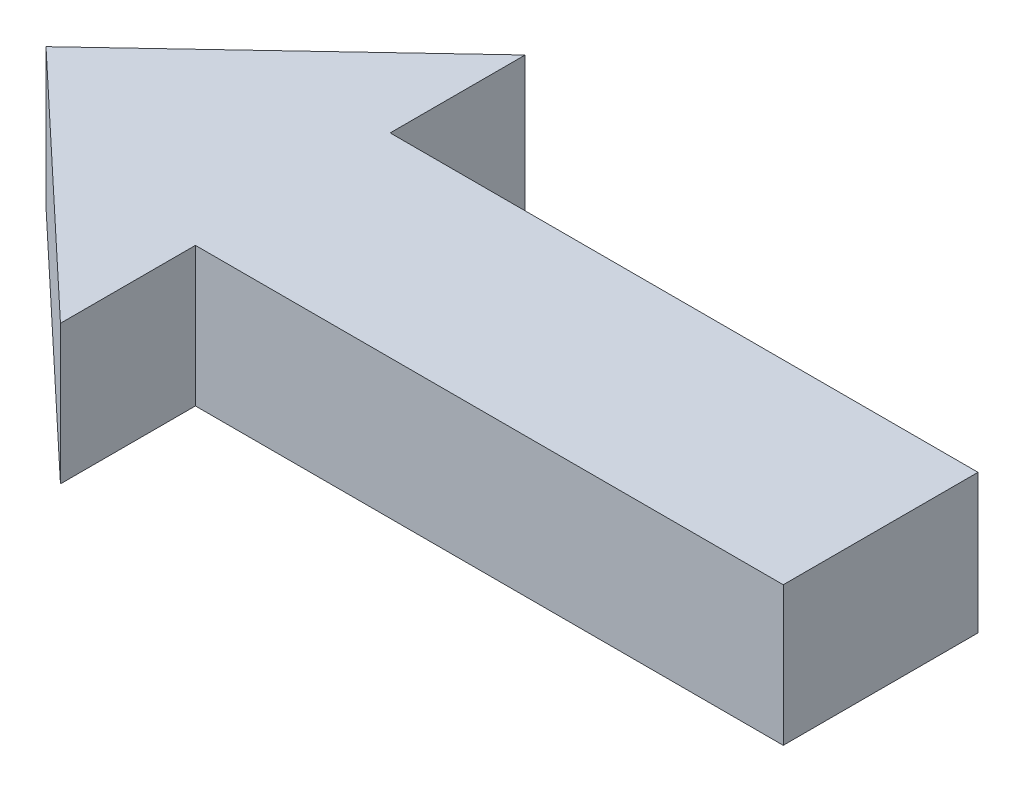
ISO-10303-21;
HEADER;
FILE_DESCRIPTION(('STEP AP214'),'2;1');
FILE_NAME('part.step','',(''),(''),'','','');
FILE_SCHEMA(('AUTOMOTIVE_DESIGN { 1 0 10303 214 1 1 1 1 }'));
ENDSEC;
DATA;
#1=APPLICATION_CONTEXT('core data for automotive mechanical design processes');
#2=APPLICATION_PROTOCOL_DEFINITION('international standard','automotive_design',2000,#1);
#3=PRODUCT_CONTEXT('',#1,'mechanical');
#4=PRODUCT('Part','Part','',(#3));
#5=PRODUCT_RELATED_PRODUCT_CATEGORY('part','',(#4));
#6=PRODUCT_DEFINITION_FORMATION('','',#4);
#7=PRODUCT_DEFINITION_CONTEXT('part definition',#1,'design');
#8=PRODUCT_DEFINITION('design','',#6,#7);
#9=PRODUCT_DEFINITION_SHAPE('','',#8);
#10=(LENGTH_UNIT() NAMED_UNIT(*) SI_UNIT(.MILLI.,.METRE.));
#11=(NAMED_UNIT(*) PLANE_ANGLE_UNIT() SI_UNIT($,.RADIAN.));
#12=(NAMED_UNIT(*) SI_UNIT($,.STERADIAN.) SOLID_ANGLE_UNIT());
#13=UNCERTAINTY_MEASURE_WITH_UNIT(LENGTH_MEASURE(1.E-05),#10,'distance_accuracy_value','');
#14=(GEOMETRIC_REPRESENTATION_CONTEXT(3) GLOBAL_UNCERTAINTY_ASSIGNED_CONTEXT((#13)) GLOBAL_UNIT_ASSIGNED_CONTEXT((#10,
#11,#12)) REPRESENTATION_CONTEXT('',''));
#15=CARTESIAN_POINT('',(0.,0.,0.));
#16=DIRECTION('',(0.,0.,1.));
#17=DIRECTION('',(1.,0.,0.));
#18=AXIS2_PLACEMENT_3D('',#15,#16,#17);
#19=CARTESIAN_POINT('',(0.,50.,0.));
#20=DIRECTION('',(-1.,0.,0.));
#21=DIRECTION('',(0.,0.,1.));
#22=AXIS2_PLACEMENT_3D('',#19,#20,#21);
#23=PLANE('',#22);
#24=DIRECTION('',(0.,0.,-1.));
#25=VECTOR('',#24,1.);
#26=CARTESIAN_POINT('',(0.,0.,0.));
#27=LINE('',#26,#25);
#28=CARTESIAN_POINT('',(0.,0.,70.));
#29=VERTEX_POINT('',#28);
#30=CARTESIAN_POINT('',(0.,0.,0.));
#31=VERTEX_POINT('',#30);
#32=EDGE_CURVE('E123',#29,#31,#27,.T.);
#33=ORIENTED_EDGE('',*,*,#32,.T.);
#34=DIRECTION('',(0.,-1.,0.));
#35=VECTOR('',#34,1.);
#36=CARTESIAN_POINT('',(0.,50.,0.));
#37=LINE('',#36,#35);
#38=CARTESIAN_POINT('',(0.,50.,0.));
#39=VERTEX_POINT('',#38);
#40=EDGE_CURVE('E11',#39,#31,#37,.T.);
#41=ORIENTED_EDGE('',*,*,#40,.F.);
#42=DIRECTION('',(0.,0.,-1.));
#43=VECTOR('',#42,1.);
#44=CARTESIAN_POINT('',(0.,50.,0.));
#45=LINE('',#44,#43);
#46=CARTESIAN_POINT('',(0.,50.,70.));
#47=VERTEX_POINT('',#46);
#48=EDGE_CURVE('E135',#47,#39,#45,.T.);
#49=ORIENTED_EDGE('',*,*,#48,.F.);
#50=DIRECTION('',(0.,-1.,0.));
#51=VECTOR('',#50,1.);
#52=CARTESIAN_POINT('',(0.,50.,70.));
#53=LINE('',#52,#51);
#54=EDGE_CURVE('E119',#47,#29,#53,.T.);
#55=ORIENTED_EDGE('',*,*,#54,.T.);
#56=EDGE_LOOP('',(#33,#41,#49,#55));
#57=FACE_BOUND('',#56,.T.);
#58=ADVANCED_FACE('F33',(#57),#23,.F.);
#59=CARTESIAN_POINT('',(0.,50.,0.));
#60=DIRECTION('',(0.,0.,1.));
#61=DIRECTION('',(1.,0.,0.));
#62=AXIS2_PLACEMENT_3D('',#59,#60,#61);
#63=PLANE('',#62);
#64=DIRECTION('',(-1.,0.,0.));
#65=VECTOR('',#64,1.);
#66=CARTESIAN_POINT('',(0.,0.,0.));
#67=LINE('',#66,#65);
#68=CARTESIAN_POINT('',(-211.29363449692,0.,0.));
#69=VERTEX_POINT('',#68);
#70=EDGE_CURVE('E126',#31,#69,#67,.T.);
#71=ORIENTED_EDGE('',*,*,#70,.T.);
#72=DIRECTION('',(0.,-1.,0.));
#73=VECTOR('',#72,1.);
#74=CARTESIAN_POINT('',(-211.29363449692,50.,0.));
#75=LINE('',#74,#73);
#76=CARTESIAN_POINT('',(-211.29363449692,50.,0.));
#77=VERTEX_POINT('',#76);
#78=EDGE_CURVE('E41',#77,#69,#75,.T.);
#79=ORIENTED_EDGE('',*,*,#78,.F.);
#80=DIRECTION('',(-1.,0.,0.));
#81=VECTOR('',#80,1.);
#82=CARTESIAN_POINT('',(0.,50.,0.));
#83=LINE('',#82,#81);
#84=EDGE_CURVE('E89',#39,#77,#83,.T.);
#85=ORIENTED_EDGE('',*,*,#84,.F.);
#86=ORIENTED_EDGE('',*,*,#40,.T.);
#87=EDGE_LOOP('',(#71,#79,#85,#86));
#88=FACE_BOUND('',#87,.T.);
#89=ADVANCED_FACE('F160',(#88),#63,.F.);
#90=CARTESIAN_POINT('',(-211.29363449692,50.,0.));
#91=DIRECTION('',(-1.,0.,0.));
#92=DIRECTION('',(0.,0.,1.));
#93=AXIS2_PLACEMENT_3D('',#90,#91,#92);
#94=PLANE('',#93);
#95=DIRECTION('',(0.,0.,-1.));
#96=VECTOR('',#95,1.);
#97=CARTESIAN_POINT('',(-211.29363449692,0.,0.));
#98=LINE('',#97,#96);
#99=CARTESIAN_POINT('',(-211.29363449692,0.,-48.5112936344969));
#100=VERTEX_POINT('',#99);
#101=EDGE_CURVE('E128',#69,#100,#98,.T.);
#102=ORIENTED_EDGE('',*,*,#101,.T.);
#103=DIRECTION('',(0.,-1.,0.));
#104=VECTOR('',#103,1.);
#105=CARTESIAN_POINT('',(-211.29363449692,50.,-48.5112936344969));
#106=LINE('',#105,#104);
#107=CARTESIAN_POINT('',(-211.29363449692,50.,-48.5112936344969));
#108=VERTEX_POINT('',#107);
#109=EDGE_CURVE('E139',#108,#100,#106,.T.);
#110=ORIENTED_EDGE('',*,*,#109,.F.);
#111=DIRECTION('',(0.,0.,-1.));
#112=VECTOR('',#111,1.);
#113=CARTESIAN_POINT('',(-211.29363449692,50.,0.));
#114=LINE('',#113,#112);
#115=EDGE_CURVE('E147',#77,#108,#114,.T.);
#116=ORIENTED_EDGE('',*,*,#115,.F.);
#117=ORIENTED_EDGE('',*,*,#78,.T.);
#118=EDGE_LOOP('',(#102,#110,#116,#117));
#119=FACE_BOUND('',#118,.T.);
#120=ADVANCED_FACE('F145',(#119),#94,.F.);
#121=CARTESIAN_POINT('',(-211.29363449692,50.,-48.5112936344969));
#122=DIRECTION('',(0.68546458137336,0.,0.728105972838188));
#123=DIRECTION('',(0.728105972838188,0.,-0.68546458137336));
#124=AXIS2_PLACEMENT_3D('',#121,#122,#123);
#125=PLANE('',#124);
#126=DIRECTION('',(-0.728105972838188,0.,0.68546458137336));
#127=VECTOR('',#126,1.);
#128=CARTESIAN_POINT('',(-211.29363449692,0.,-48.5112936344969));
#129=LINE('',#128,#127);
#130=CARTESIAN_POINT('',(-300.,0.,35.));
#131=VERTEX_POINT('',#130);
#132=EDGE_CURVE('E130',#100,#131,#129,.T.);
#133=ORIENTED_EDGE('',*,*,#132,.T.);
#134=DIRECTION('',(0.,-1.,0.));
#135=VECTOR('',#134,1.);
#136=CARTESIAN_POINT('',(-300.,50.,35.));
#137=LINE('',#136,#135);
#138=CARTESIAN_POINT('',(-300.,50.,35.));
#139=VERTEX_POINT('',#138);
#140=EDGE_CURVE('E114',#139,#131,#137,.T.);
#141=ORIENTED_EDGE('',*,*,#140,.F.);
#142=DIRECTION('',(-0.728105972838188,0.,0.68546458137336));
#143=VECTOR('',#142,1.);
#144=CARTESIAN_POINT('',(-211.29363449692,50.,-48.5112936344969));
#145=LINE('',#144,#143);
#146=EDGE_CURVE('E105',#108,#139,#145,.T.);
#147=ORIENTED_EDGE('',*,*,#146,.F.);
#148=ORIENTED_EDGE('',*,*,#109,.T.);
#149=EDGE_LOOP('',(#133,#141,#147,#148));
#150=FACE_BOUND('',#149,.T.);
#151=ADVANCED_FACE('F153',(#150),#125,.F.);
#152=CARTESIAN_POINT('',(-300.,50.,35.));
#153=DIRECTION('',(0.68546458137336,0.,-0.728105972838188));
#154=DIRECTION('',(-0.728105972838188,0.,-0.68546458137336));
#155=AXIS2_PLACEMENT_3D('',#152,#153,#154);
#156=PLANE('',#155);
#157=DIRECTION('',(0.728105972838188,0.,0.68546458137336));
#158=VECTOR('',#157,1.);
#159=CARTESIAN_POINT('',(-300.,0.,35.));
#160=LINE('',#159,#158);
#161=CARTESIAN_POINT('',(-211.29363449692,0.,118.511293634497));
#162=VERTEX_POINT('',#161);
#163=EDGE_CURVE('E113',#131,#162,#160,.T.);
#164=ORIENTED_EDGE('',*,*,#163,.T.);
#165=DIRECTION('',(0.,-1.,0.));
#166=VECTOR('',#165,1.);
#167=CARTESIAN_POINT('',(-211.29363449692,50.,118.511293634497));
#168=LINE('',#167,#166);
#169=CARTESIAN_POINT('',(-211.29363449692,50.,118.511293634497));
#170=VERTEX_POINT('',#169);
#171=EDGE_CURVE('E110',#170,#162,#168,.T.);
#172=ORIENTED_EDGE('',*,*,#171,.F.);
#173=DIRECTION('',(0.728105972838188,0.,0.68546458137336));
#174=VECTOR('',#173,1.);
#175=CARTESIAN_POINT('',(-300.,50.,35.));
#176=LINE('',#175,#174);
#177=EDGE_CURVE('E99',#139,#170,#176,.T.);
#178=ORIENTED_EDGE('',*,*,#177,.F.);
#179=ORIENTED_EDGE('',*,*,#140,.T.);
#180=EDGE_LOOP('',(#164,#172,#178,#179));
#181=FACE_BOUND('',#180,.T.);
#182=ADVANCED_FACE('F111',(#181),#156,.F.);
#183=CARTESIAN_POINT('',(-211.29363449692,50.,118.511293634497));
#184=DIRECTION('',(-1.,0.,0.));
#185=DIRECTION('',(0.,0.,1.));
#186=AXIS2_PLACEMENT_3D('',#183,#184,#185);
#187=PLANE('',#186);
#188=DIRECTION('',(0.,0.,-1.));
#189=VECTOR('',#188,1.);
#190=CARTESIAN_POINT('',(-211.29363449692,0.,118.511293634497));
#191=LINE('',#190,#189);
#192=CARTESIAN_POINT('',(-211.29363449692,0.,70.));
#193=VERTEX_POINT('',#192);
#194=EDGE_CURVE('E75',#162,#193,#191,.T.);
#195=ORIENTED_EDGE('',*,*,#194,.T.);
#196=DIRECTION('',(0.,-1.,0.));
#197=VECTOR('',#196,1.);
#198=CARTESIAN_POINT('',(-211.29363449692,50.,70.));
#199=LINE('',#198,#197);
#200=CARTESIAN_POINT('',(-211.29363449692,50.,70.));
#201=VERTEX_POINT('',#200);
#202=EDGE_CURVE('E115',#201,#193,#199,.T.);
#203=ORIENTED_EDGE('',*,*,#202,.F.);
#204=DIRECTION('',(0.,0.,-1.));
#205=VECTOR('',#204,1.);
#206=CARTESIAN_POINT('',(-211.29363449692,50.,118.511293634497));
#207=LINE('',#206,#205);
#208=EDGE_CURVE('E103',#170,#201,#207,.T.);
#209=ORIENTED_EDGE('',*,*,#208,.F.);
#210=ORIENTED_EDGE('',*,*,#171,.T.);
#211=EDGE_LOOP('',(#195,#203,#209,#210));
#212=FACE_BOUND('',#211,.T.);
#213=ADVANCED_FACE('F117',(#212),#187,.F.);
#214=CARTESIAN_POINT('',(0.,50.,70.));
#215=DIRECTION('',(0.,0.,-1.));
#216=DIRECTION('',(-1.,0.,0.));
#217=AXIS2_PLACEMENT_3D('',#214,#215,#216);
#218=PLANE('',#217);
#219=DIRECTION('',(1.,0.,0.));
#220=VECTOR('',#219,1.);
#221=CARTESIAN_POINT('',(0.,0.,70.));
#222=LINE('',#221,#220);
#223=EDGE_CURVE('E81',#193,#29,#222,.T.);
#224=ORIENTED_EDGE('',*,*,#223,.T.);
#225=ORIENTED_EDGE('',*,*,#54,.F.);
#226=DIRECTION('',(1.,0.,0.));
#227=VECTOR('',#226,1.);
#228=CARTESIAN_POINT('',(0.,50.,70.));
#229=LINE('',#228,#227);
#230=EDGE_CURVE('E49',#201,#47,#229,.T.);
#231=ORIENTED_EDGE('',*,*,#230,.F.);
#232=ORIENTED_EDGE('',*,*,#202,.T.);
#233=EDGE_LOOP('',(#224,#225,#231,#232));
#234=FACE_BOUND('',#233,.T.);
#235=ADVANCED_FACE('F174',(#234),#218,.F.);
#236=CARTESIAN_POINT('',(0.,50.,0.));
#237=DIRECTION('',(0.,-1.,0.));
#238=DIRECTION('',(0.,0.,-1.));
#239=AXIS2_PLACEMENT_3D('',#236,#237,#238);
#240=PLANE('',#239);
#241=ORIENTED_EDGE('',*,*,#48,.T.);
#242=ORIENTED_EDGE('',*,*,#84,.T.);
#243=ORIENTED_EDGE('',*,*,#115,.T.);
#244=ORIENTED_EDGE('',*,*,#146,.T.);
#245=ORIENTED_EDGE('',*,*,#177,.T.);
#246=ORIENTED_EDGE('',*,*,#208,.T.);
#247=ORIENTED_EDGE('',*,*,#230,.T.);
#248=EDGE_LOOP('',(#241,#242,#243,#244,#245,#246,#247));
#249=FACE_BOUND('',#248,.T.);
#250=ADVANCED_FACE('F101',(#249),#240,.F.);
#251=CARTESIAN_POINT('',(0.,0.,0.));
#252=DIRECTION('',(0.,-1.,0.));
#253=DIRECTION('',(0.,0.,-1.));
#254=AXIS2_PLACEMENT_3D('',#251,#252,#253);
#255=PLANE('',#254);
#256=ORIENTED_EDGE('',*,*,#32,.F.);
#257=ORIENTED_EDGE('',*,*,#223,.F.);
#258=ORIENTED_EDGE('',*,*,#194,.F.);
#259=ORIENTED_EDGE('',*,*,#163,.F.);
#260=ORIENTED_EDGE('',*,*,#132,.F.);
#261=ORIENTED_EDGE('',*,*,#101,.F.);
#262=ORIENTED_EDGE('',*,*,#70,.F.);
#263=EDGE_LOOP('',(#256,#257,#258,#259,#260,#261,#262));
#264=FACE_BOUND('',#263,.T.);
#265=ADVANCED_FACE('F151',(#264),#255,.T.);
#266=CLOSED_SHELL('',(#58,#89,#120,#151,#182,#213,#235,#250,#265));
#267=MANIFOLD_SOLID_BREP('B2',#266);
#268=ADVANCED_BREP_SHAPE_REPRESENTATION('',(#18,#267),#14);
#269=SHAPE_DEFINITION_REPRESENTATION(#9,#268);
ENDSEC;
END-ISO-10303-21;
